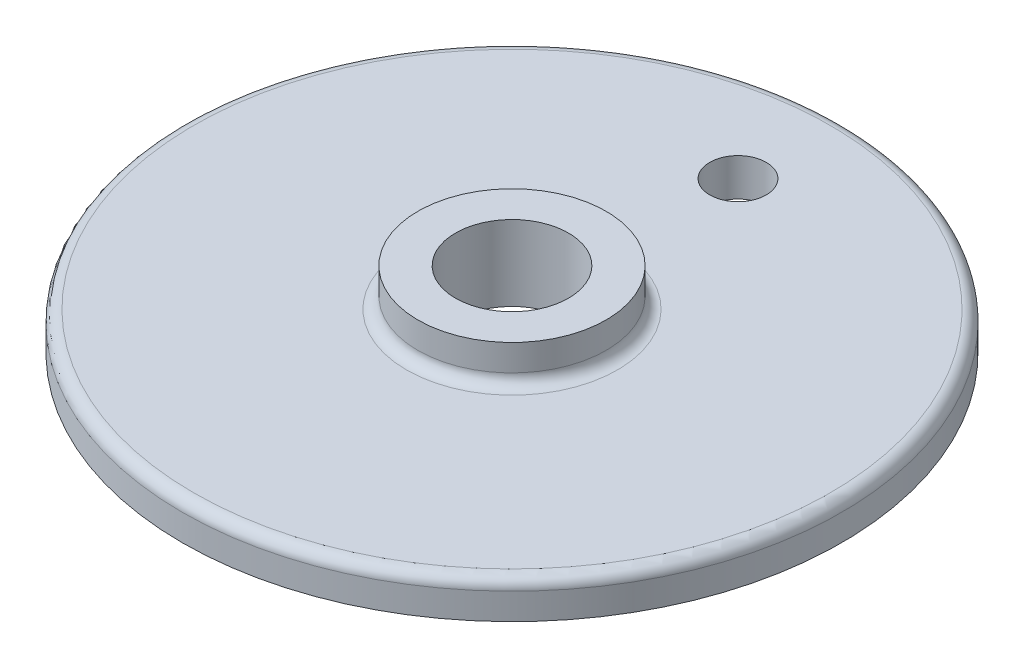
ISO-10303-21;
HEADER;
FILE_DESCRIPTION(('STEP AP214'),'2;1');
FILE_NAME('part.step','',(''),(''),'','','');
FILE_SCHEMA(('AUTOMOTIVE_DESIGN { 1 0 10303 214 1 1 1 1 }'));
ENDSEC;
DATA;
#1=APPLICATION_CONTEXT('core data for automotive mechanical design processes');
#2=APPLICATION_PROTOCOL_DEFINITION('international standard','automotive_design',2000,#1);
#3=PRODUCT_CONTEXT('',#1,'mechanical');
#4=PRODUCT('Part','Part','',(#3));
#5=PRODUCT_RELATED_PRODUCT_CATEGORY('part','',(#4));
#6=PRODUCT_DEFINITION_FORMATION('','',#4);
#7=PRODUCT_DEFINITION_CONTEXT('part definition',#1,'design');
#8=PRODUCT_DEFINITION('design','',#6,#7);
#9=PRODUCT_DEFINITION_SHAPE('','',#8);
#10=(LENGTH_UNIT() NAMED_UNIT(*) SI_UNIT(.MILLI.,.METRE.));
#11=(NAMED_UNIT(*) PLANE_ANGLE_UNIT() SI_UNIT($,.RADIAN.));
#12=(NAMED_UNIT(*) SI_UNIT($,.STERADIAN.) SOLID_ANGLE_UNIT());
#13=UNCERTAINTY_MEASURE_WITH_UNIT(LENGTH_MEASURE(1.E-05),#10,'distance_accuracy_value','');
#14=(GEOMETRIC_REPRESENTATION_CONTEXT(3) GLOBAL_UNCERTAINTY_ASSIGNED_CONTEXT((#13)) GLOBAL_UNIT_ASSIGNED_CONTEXT((#10,
#11,#12)) REPRESENTATION_CONTEXT('',''));
#15=CARTESIAN_POINT('',(0.,0.,0.));
#16=DIRECTION('',(0.,0.,1.));
#17=DIRECTION('',(1.,0.,0.));
#18=AXIS2_PLACEMENT_3D('',#15,#16,#17);
#19=CARTESIAN_POINT('',(0.,10.,0.));
#20=DIRECTION('',(0.,1.,0.));
#21=DIRECTION('',(0.,0.,1.));
#22=AXIS2_PLACEMENT_3D('',#19,#20,#21);
#23=PLANE('',#22);
#24=CARTESIAN_POINT('',(0.,10.,-60.));
#25=DIRECTION('',(0.,1.,0.));
#26=DIRECTION('',(0.,0.,1.));
#27=AXIS2_PLACEMENT_3D('',#24,#25,#26);
#28=CIRCLE('',#27,7.5);
#29=CARTESIAN_POINT('',(0.,10.,-52.5));
#30=VERTEX_POINT('',#29);
#31=EDGE_CURVE('E63',#30,#30,#28,.T.);
#32=ORIENTED_EDGE('',*,*,#31,.F.);
#33=EDGE_LOOP('',(#32));
#34=FACE_BOUND('',#33,.T.);
#35=CARTESIAN_POINT('',(0.,10.,0.));
#36=DIRECTION('',(0.,1.,0.));
#37=DIRECTION('',(0.,0.,1.));
#38=AXIS2_PLACEMENT_3D('',#35,#36,#37);
#39=CIRCLE('',#38,28.);
#40=CARTESIAN_POINT('',(0.,10.,28.));
#41=VERTEX_POINT('',#40);
#42=EDGE_CURVE('E37',#41,#41,#39,.F.);
#43=ORIENTED_EDGE('',*,*,#42,.T.);
#44=EDGE_LOOP('',(#43));
#45=FACE_BOUND('',#44,.T.);
#46=CARTESIAN_POINT('',(0.,10.,0.));
#47=DIRECTION('',(0.,1.,0.));
#48=DIRECTION('',(0.,0.,1.));
#49=AXIS2_PLACEMENT_3D('',#46,#47,#48);
#50=CIRCLE('',#49,84.5);
#51=CARTESIAN_POINT('',(0.,10.,84.5));
#52=VERTEX_POINT('',#51);
#53=EDGE_CURVE('E41',#52,#52,#50,.T.);
#54=ORIENTED_EDGE('',*,*,#53,.T.);
#55=EDGE_LOOP('',(#54));
#56=FACE_BOUND('',#55,.T.);
#57=ADVANCED_FACE('F30',(#34,#45,#56),#23,.T.);
#58=CARTESIAN_POINT('',(0.,10.,0.));
#59=DIRECTION('',(0.,-1.,0.));
#60=DIRECTION('',(0.,0.,-1.));
#61=AXIS2_PLACEMENT_3D('',#58,#59,#60);
#62=CYLINDRICAL_SURFACE('',#61,87.5);
#63=CARTESIAN_POINT('',(0.,7.,0.));
#64=DIRECTION('',(0.,1.,0.));
#65=DIRECTION('',(0.,0.,1.));
#66=AXIS2_PLACEMENT_3D('',#63,#64,#65);
#67=CIRCLE('',#66,87.5);
#68=CARTESIAN_POINT('',(0.,7.,87.5));
#69=VERTEX_POINT('',#68);
#70=EDGE_CURVE('E10',#69,#69,#67,.F.);
#71=ORIENTED_EDGE('',*,*,#70,.T.);
#72=EDGE_LOOP('',(#71));
#73=FACE_BOUND('',#72,.T.);
#74=CARTESIAN_POINT('',(0.,0.,0.));
#75=DIRECTION('',(0.,1.,0.));
#76=DIRECTION('',(0.,0.,1.));
#77=AXIS2_PLACEMENT_3D('',#74,#75,#76);
#78=CIRCLE('',#77,87.5);
#79=CARTESIAN_POINT('',(0.,0.,87.5));
#80=VERTEX_POINT('',#79);
#81=EDGE_CURVE('E50',#80,#80,#78,.T.);
#82=ORIENTED_EDGE('',*,*,#81,.T.);
#83=EDGE_LOOP('',(#82));
#84=FACE_BOUND('',#83,.T.);
#85=ADVANCED_FACE('F79',(#73,#84),#62,.T.);
#86=CARTESIAN_POINT('',(0.,0.,0.));
#87=DIRECTION('',(0.,1.,0.));
#88=DIRECTION('',(0.,0.,1.));
#89=AXIS2_PLACEMENT_3D('',#86,#87,#88);
#90=PLANE('',#89);
#91=CARTESIAN_POINT('',(0.,0.,-60.));
#92=DIRECTION('',(0.,1.,0.));
#93=DIRECTION('',(0.,0.,1.));
#94=AXIS2_PLACEMENT_3D('',#91,#92,#93);
#95=CIRCLE('',#94,7.5);
#96=CARTESIAN_POINT('',(0.,0.,-52.5));
#97=VERTEX_POINT('',#96);
#98=EDGE_CURVE('E60',#97,#97,#95,.T.);
#99=ORIENTED_EDGE('',*,*,#98,.T.);
#100=EDGE_LOOP('',(#99));
#101=FACE_BOUND('',#100,.T.);
#102=CARTESIAN_POINT('',(0.,0.,0.));
#103=DIRECTION('',(0.,1.,0.));
#104=DIRECTION('',(0.,0.,1.));
#105=AXIS2_PLACEMENT_3D('',#102,#103,#104);
#106=CIRCLE('',#105,15.);
#107=CARTESIAN_POINT('',(0.,0.,15.));
#108=VERTEX_POINT('',#107);
#109=EDGE_CURVE('E56',#108,#108,#106,.T.);
#110=ORIENTED_EDGE('',*,*,#109,.T.);
#111=EDGE_LOOP('',(#110));
#112=FACE_BOUND('',#111,.T.);
#113=ORIENTED_EDGE('',*,*,#81,.F.);
#114=EDGE_LOOP('',(#113));
#115=FACE_BOUND('',#114,.T.);
#116=ADVANCED_FACE('F69',(#101,#112,#115),#90,.F.);
#117=CARTESIAN_POINT('',(0.,20.,0.));
#118=DIRECTION('',(0.,-1.,0.));
#119=DIRECTION('',(0.,0.,-1.));
#120=AXIS2_PLACEMENT_3D('',#117,#118,#119);
#121=CYLINDRICAL_SURFACE('',#120,25.);
#122=CARTESIAN_POINT('',(0.,13.,0.));
#123=DIRECTION('',(0.,1.,0.));
#124=DIRECTION('',(0.,0.,1.));
#125=AXIS2_PLACEMENT_3D('',#122,#123,#124);
#126=CIRCLE('',#125,25.);
#127=CARTESIAN_POINT('',(0.,13.,25.));
#128=VERTEX_POINT('',#127);
#129=EDGE_CURVE('E45',#128,#128,#126,.T.);
#130=ORIENTED_EDGE('',*,*,#129,.T.);
#131=EDGE_LOOP('',(#130));
#132=FACE_BOUND('',#131,.T.);
#133=CARTESIAN_POINT('',(0.,20.,0.));
#134=DIRECTION('',(0.,1.,0.));
#135=DIRECTION('',(0.,0.,1.));
#136=AXIS2_PLACEMENT_3D('',#133,#134,#135);
#137=CIRCLE('',#136,25.);
#138=CARTESIAN_POINT('',(0.,20.,25.));
#139=VERTEX_POINT('',#138);
#140=EDGE_CURVE('E53',#139,#139,#137,.T.);
#141=ORIENTED_EDGE('',*,*,#140,.F.);
#142=EDGE_LOOP('',(#141));
#143=FACE_BOUND('',#142,.T.);
#144=ADVANCED_FACE('F103',(#132,#143),#121,.T.);
#145=CARTESIAN_POINT('',(0.,20.,0.));
#146=DIRECTION('',(0.,1.,0.));
#147=DIRECTION('',(0.,0.,1.));
#148=AXIS2_PLACEMENT_3D('',#145,#146,#147);
#149=PLANE('',#148);
#150=CARTESIAN_POINT('',(0.,20.,0.));
#151=DIRECTION('',(0.,1.,0.));
#152=DIRECTION('',(0.,0.,1.));
#153=AXIS2_PLACEMENT_3D('',#150,#151,#152);
#154=CIRCLE('',#153,15.);
#155=CARTESIAN_POINT('',(0.,20.,15.));
#156=VERTEX_POINT('',#155);
#157=EDGE_CURVE('E57',#156,#156,#154,.T.);
#158=ORIENTED_EDGE('',*,*,#157,.F.);
#159=EDGE_LOOP('',(#158));
#160=FACE_BOUND('',#159,.T.);
#161=ORIENTED_EDGE('',*,*,#140,.T.);
#162=EDGE_LOOP('',(#161));
#163=FACE_BOUND('',#162,.T.);
#164=ADVANCED_FACE('F95',(#160,#163),#149,.T.);
#165=CARTESIAN_POINT('',(0.,0.,0.));
#166=DIRECTION('',(0.,1.,0.));
#167=DIRECTION('',(0.,0.,1.));
#168=AXIS2_PLACEMENT_3D('',#165,#166,#167);
#169=CYLINDRICAL_SURFACE('',#168,15.);
#170=ORIENTED_EDGE('',*,*,#109,.F.);
#171=EDGE_LOOP('',(#170));
#172=FACE_BOUND('',#171,.T.);
#173=ORIENTED_EDGE('',*,*,#157,.T.);
#174=EDGE_LOOP('',(#173));
#175=FACE_BOUND('',#174,.T.);
#176=ADVANCED_FACE('F90',(#172,#175),#169,.F.);
#177=CARTESIAN_POINT('',(0.,13.,0.));
#178=DIRECTION('',(0.,1.,0.));
#179=DIRECTION('',(0.,0.,1.));
#180=AXIS2_PLACEMENT_3D('',#177,#178,#179);
#181=TOROIDAL_SURFACE('',#180,28.,3.);
#182=ORIENTED_EDGE('',*,*,#42,.F.);
#183=EDGE_LOOP('',(#182));
#184=FACE_BOUND('',#183,.T.);
#185=ORIENTED_EDGE('',*,*,#129,.F.);
#186=EDGE_LOOP('',(#185));
#187=FACE_BOUND('',#186,.T.);
#188=ADVANCED_FACE('F85',(#184,#187),#181,.F.);
#189=CARTESIAN_POINT('',(0.,7.,0.));
#190=DIRECTION('',(0.,1.,0.));
#191=DIRECTION('',(0.,0.,1.));
#192=AXIS2_PLACEMENT_3D('',#189,#190,#191);
#193=TOROIDAL_SURFACE('',#192,84.5,3.);
#194=ORIENTED_EDGE('',*,*,#70,.F.);
#195=EDGE_LOOP('',(#194));
#196=FACE_BOUND('',#195,.T.);
#197=ORIENTED_EDGE('',*,*,#53,.F.);
#198=EDGE_LOOP('',(#197));
#199=FACE_BOUND('',#198,.T.);
#200=ADVANCED_FACE('F32',(#196,#199),#193,.T.);
#201=CARTESIAN_POINT('',(0.,0.,-60.));
#202=DIRECTION('',(0.,1.,0.));
#203=DIRECTION('',(0.,0.,1.));
#204=AXIS2_PLACEMENT_3D('',#201,#202,#203);
#205=CYLINDRICAL_SURFACE('',#204,7.5);
#206=ORIENTED_EDGE('',*,*,#98,.F.);
#207=EDGE_LOOP('',(#206));
#208=FACE_BOUND('',#207,.T.);
#209=ORIENTED_EDGE('',*,*,#31,.T.);
#210=EDGE_LOOP('',(#209));
#211=FACE_BOUND('',#210,.T.);
#212=ADVANCED_FACE('F72',(#208,#211),#205,.F.);
#213=CLOSED_SHELL('',(#57,#85,#116,#144,#164,#176,#188,#200,#212));
#214=MANIFOLD_SOLID_BREP('B2',#213);
#215=ADVANCED_BREP_SHAPE_REPRESENTATION('',(#18,#214),#14);
#216=SHAPE_DEFINITION_REPRESENTATION(#9,#215);
ENDSEC;
END-ISO-10303-21;
